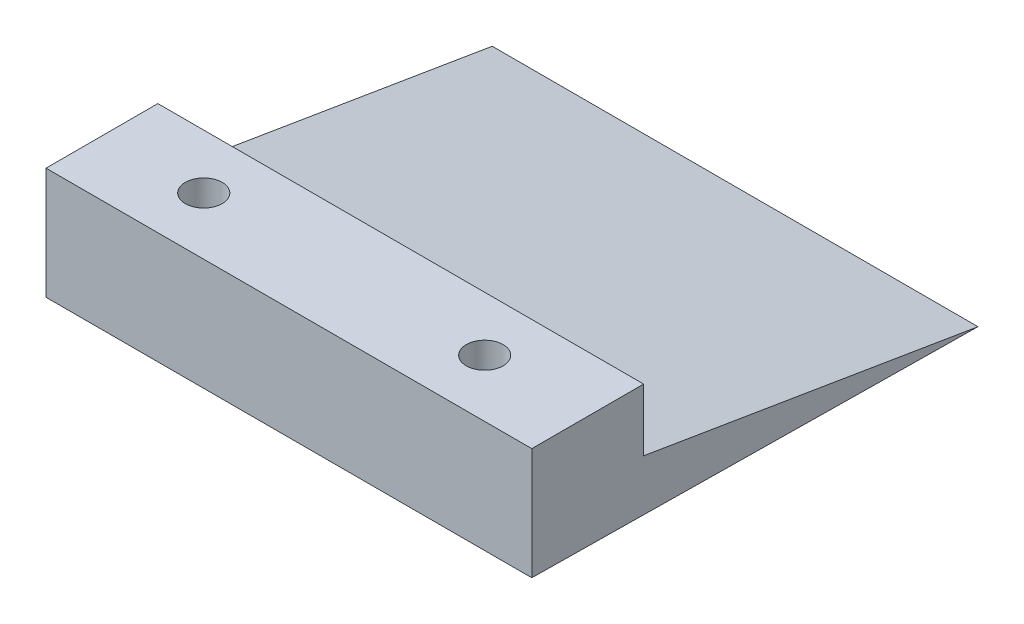
ISO-10303-21;
HEADER;
FILE_DESCRIPTION(('STEP AP214'),'2;1');
FILE_NAME('part.step','',(''),(''),'','','');
FILE_SCHEMA(('AUTOMOTIVE_DESIGN { 1 0 10303 214 1 1 1 1 }'));
ENDSEC;
DATA;
#1=APPLICATION_CONTEXT('core data for automotive mechanical design processes');
#2=APPLICATION_PROTOCOL_DEFINITION('international standard','automotive_design',2000,#1);
#3=PRODUCT_CONTEXT('',#1,'mechanical');
#4=PRODUCT('Part','Part','',(#3));
#5=PRODUCT_RELATED_PRODUCT_CATEGORY('part','',(#4));
#6=PRODUCT_DEFINITION_FORMATION('','',#4);
#7=PRODUCT_DEFINITION_CONTEXT('part definition',#1,'design');
#8=PRODUCT_DEFINITION('design','',#6,#7);
#9=PRODUCT_DEFINITION_SHAPE('','',#8);
#10=(LENGTH_UNIT() NAMED_UNIT(*) SI_UNIT(.MILLI.,.METRE.));
#11=(NAMED_UNIT(*) PLANE_ANGLE_UNIT() SI_UNIT($,.RADIAN.));
#12=(NAMED_UNIT(*) SI_UNIT($,.STERADIAN.) SOLID_ANGLE_UNIT());
#13=UNCERTAINTY_MEASURE_WITH_UNIT(LENGTH_MEASURE(1.E-05),#10,'distance_accuracy_value','');
#14=(GEOMETRIC_REPRESENTATION_CONTEXT(3) GLOBAL_UNCERTAINTY_ASSIGNED_CONTEXT((#13)) GLOBAL_UNIT_ASSIGNED_CONTEXT((#10,
#11,#12)) REPRESENTATION_CONTEXT('',''));
#15=CARTESIAN_POINT('',(0.,0.,0.));
#16=DIRECTION('',(0.,0.,1.));
#17=DIRECTION('',(1.,0.,0.));
#18=AXIS2_PLACEMENT_3D('',#15,#16,#17);
#19=CARTESIAN_POINT('',(21.5,5.5,9.9));
#20=DIRECTION('',(0.,0.,-1.));
#21=DIRECTION('',(0.,1.,0.));
#22=AXIS2_PLACEMENT_3D('',#19,#20,#21);
#23=PLANE('',#22);
#24=DIRECTION('',(0.,-1.,0.));
#25=VECTOR('',#24,1.);
#26=CARTESIAN_POINT('',(-21.5,5.5,9.9));
#27=LINE('',#26,#25);
#28=CARTESIAN_POINT('',(-21.5,5.5,9.9));
#29=VERTEX_POINT('',#28);
#30=CARTESIAN_POINT('',(-21.5,-4.4,9.9));
#31=VERTEX_POINT('',#30);
#32=EDGE_CURVE('E109',#29,#31,#27,.T.);
#33=ORIENTED_EDGE('',*,*,#32,.T.);
#34=DIRECTION('',(-1.,0.,0.));
#35=VECTOR('',#34,1.);
#36=CARTESIAN_POINT('',(21.5,-4.4,9.9));
#37=LINE('',#36,#35);
#38=CARTESIAN_POINT('',(21.5,-4.4,9.9));
#39=VERTEX_POINT('',#38);
#40=EDGE_CURVE('E11',#39,#31,#37,.T.);
#41=ORIENTED_EDGE('',*,*,#40,.F.);
#42=DIRECTION('',(0.,-1.,0.));
#43=VECTOR('',#42,1.);
#44=CARTESIAN_POINT('',(21.5,5.5,9.9));
#45=LINE('',#44,#43);
#46=CARTESIAN_POINT('',(21.5,5.5,9.9));
#47=VERTEX_POINT('',#46);
#48=EDGE_CURVE('E118',#47,#39,#45,.T.);
#49=ORIENTED_EDGE('',*,*,#48,.F.);
#50=DIRECTION('',(-1.,0.,0.));
#51=VECTOR('',#50,1.);
#52=CARTESIAN_POINT('',(21.5,5.5,9.9));
#53=LINE('',#52,#51);
#54=EDGE_CURVE('E105',#47,#29,#53,.T.);
#55=ORIENTED_EDGE('',*,*,#54,.T.);
#56=EDGE_LOOP('',(#33,#41,#49,#55));
#57=FACE_BOUND('',#56,.T.);
#58=ADVANCED_FACE('F33',(#57),#23,.F.);
#59=CARTESIAN_POINT('',(21.5,-4.90191570066803,-29.5968110184787));
#60=DIRECTION('',(0.,0.999919266290601,-0.0127067265991904));
#61=DIRECTION('',(0.,0.0127067265991904,0.999919266290601));
#62=AXIS2_PLACEMENT_3D('',#59,#60,#61);
#63=PLANE('',#62);
#64=CARTESIAN_POINT('',(-12.615,-4.4629033750888,4.95));
#65=DIRECTION('',(0.,-0.999919266290601,0.0127067265991904));
#66=DIRECTION('',(0.,-0.0127067265991904,-0.999919266290601));
#67=AXIS2_PLACEMENT_3D('',#64,#65,#66);
#68=CIRCLE('',#67,2.77875999999999);
#69=CARTESIAN_POINT('',(-12.615,-4.49821231869357,2.17146433960233));
#70=VERTEX_POINT('',#69);
#71=EDGE_CURVE('E183',#70,#70,#68,.T.);
#72=ORIENTED_EDGE('',*,*,#71,.F.);
#73=EDGE_LOOP('',(#72));
#74=FACE_BOUND('',#73,.T.);
#75=CARTESIAN_POINT('',(12.255,-4.4629033750888,4.95));
#76=DIRECTION('',(0.,-0.999919266290601,0.0127067265991904));
#77=DIRECTION('',(0.,-0.0127067265991904,-0.999919266290601));
#78=AXIS2_PLACEMENT_3D('',#75,#76,#77);
#79=CIRCLE('',#78,2.77875999999999);
#80=CARTESIAN_POINT('',(12.255,-4.49821231869357,2.17146433960233));
#81=VERTEX_POINT('',#80);
#82=EDGE_CURVE('E131',#81,#81,#79,.T.);
#83=ORIENTED_EDGE('',*,*,#82,.F.);
#84=EDGE_LOOP('',(#83));
#85=FACE_BOUND('',#84,.T.);
#86=DIRECTION('',(0.,-0.0127067265991904,-0.999919266290601));
#87=VECTOR('',#86,1.);
#88=CARTESIAN_POINT('',(-21.5,-4.90191570066803,-29.5968110184787));
#89=LINE('',#88,#87);
#90=CARTESIAN_POINT('',(-21.5,-4.90191570066803,-29.5968110184787));
#91=VERTEX_POINT('',#90);
#92=EDGE_CURVE('E112',#31,#91,#89,.T.);
#93=ORIENTED_EDGE('',*,*,#92,.T.);
#94=DIRECTION('',(-1.,0.,0.));
#95=VECTOR('',#94,1.);
#96=CARTESIAN_POINT('',(21.5,-4.90191570066803,-29.5968110184787));
#97=LINE('',#96,#95);
#98=CARTESIAN_POINT('',(21.5,-4.90191570066803,-29.5968110184787));
#99=VERTEX_POINT('',#98);
#100=EDGE_CURVE('E42',#99,#91,#97,.T.);
#101=ORIENTED_EDGE('',*,*,#100,.F.);
#102=DIRECTION('',(0.,-0.0127067265991904,-0.999919266290601));
#103=VECTOR('',#102,1.);
#104=CARTESIAN_POINT('',(21.5,-4.90191570066803,-29.5968110184787));
#105=LINE('',#104,#103);
#106=EDGE_CURVE('E85',#39,#99,#105,.T.);
#107=ORIENTED_EDGE('',*,*,#106,.F.);
#108=ORIENTED_EDGE('',*,*,#40,.T.);
#109=EDGE_LOOP('',(#93,#101,#107,#108));
#110=FACE_BOUND('',#109,.T.);
#111=ADVANCED_FACE('F139',(#74,#85,#110),#63,.F.);
#112=CARTESIAN_POINT('',(21.5,0.,0.));
#113=DIRECTION('',(0.,-0.986560367282625,0.163397190022268));
#114=DIRECTION('',(0.,-0.163397190022268,-0.986560367282625));
#115=AXIS2_PLACEMENT_3D('',#112,#113,#114);
#116=PLANE('',#115);
#117=DIRECTION('',(0.,0.163397190022268,0.986560367282625));
#118=VECTOR('',#117,1.);
#119=CARTESIAN_POINT('',(-21.5,0.,0.));
#120=LINE('',#119,#118);
#121=CARTESIAN_POINT('',(-21.5,0.,0.));
#122=VERTEX_POINT('',#121);
#123=EDGE_CURVE('E100',#91,#122,#120,.T.);
#124=ORIENTED_EDGE('',*,*,#123,.T.);
#125=DIRECTION('',(-1.,0.,0.));
#126=VECTOR('',#125,1.);
#127=CARTESIAN_POINT('',(21.5,0.,0.));
#128=LINE('',#127,#126);
#129=CARTESIAN_POINT('',(21.5,0.,0.));
#130=VERTEX_POINT('',#129);
#131=EDGE_CURVE('E97',#130,#122,#128,.T.);
#132=ORIENTED_EDGE('',*,*,#131,.F.);
#133=DIRECTION('',(0.,0.163397190022268,0.986560367282625));
#134=VECTOR('',#133,1.);
#135=CARTESIAN_POINT('',(21.5,0.,0.));
#136=LINE('',#135,#134);
#137=EDGE_CURVE('E89',#99,#130,#136,.T.);
#138=ORIENTED_EDGE('',*,*,#137,.F.);
#139=ORIENTED_EDGE('',*,*,#100,.T.);
#140=EDGE_LOOP('',(#124,#132,#138,#139));
#141=FACE_BOUND('',#140,.T.);
#142=ADVANCED_FACE('F98',(#141),#116,.F.);
#143=CARTESIAN_POINT('',(21.5,5.5,0.));
#144=DIRECTION('',(0.,0.,1.));
#145=DIRECTION('',(0.,-1.,0.));
#146=AXIS2_PLACEMENT_3D('',#143,#144,#145);
#147=PLANE('',#146);
#148=DIRECTION('',(0.,1.,0.));
#149=VECTOR('',#148,1.);
#150=CARTESIAN_POINT('',(-21.5,5.5,0.));
#151=LINE('',#150,#149);
#152=CARTESIAN_POINT('',(-21.5,5.5,0.));
#153=VERTEX_POINT('',#152);
#154=EDGE_CURVE('E71',#122,#153,#151,.T.);
#155=ORIENTED_EDGE('',*,*,#154,.T.);
#156=DIRECTION('',(-1.,0.,0.));
#157=VECTOR('',#156,1.);
#158=CARTESIAN_POINT('',(21.5,5.5,0.));
#159=LINE('',#158,#157);
#160=CARTESIAN_POINT('',(21.5,5.5,0.));
#161=VERTEX_POINT('',#160);
#162=EDGE_CURVE('E101',#161,#153,#159,.T.);
#163=ORIENTED_EDGE('',*,*,#162,.F.);
#164=DIRECTION('',(0.,1.,0.));
#165=VECTOR('',#164,1.);
#166=CARTESIAN_POINT('',(21.5,5.5,0.));
#167=LINE('',#166,#165);
#168=EDGE_CURVE('E93',#130,#161,#167,.T.);
#169=ORIENTED_EDGE('',*,*,#168,.F.);
#170=ORIENTED_EDGE('',*,*,#131,.T.);
#171=EDGE_LOOP('',(#155,#163,#169,#170));
#172=FACE_BOUND('',#171,.T.);
#173=ADVANCED_FACE('F103',(#172),#147,.F.);
#174=CARTESIAN_POINT('',(21.5,5.5,9.9));
#175=DIRECTION('',(0.,-1.,0.));
#176=DIRECTION('',(0.,0.,-1.));
#177=AXIS2_PLACEMENT_3D('',#174,#175,#176);
#178=PLANE('',#177);
#179=CARTESIAN_POINT('',(-12.615,5.5,4.82339388929764));
#180=DIRECTION('',(0.,-1.,0.));
#181=DIRECTION('',(0.,0.,1.));
#182=AXIS2_PLACEMENT_3D('',#179,#180,#181);
#183=ELLIPSE('',#182,1.63208176401485,1.63195);
#184=CARTESIAN_POINT('',(-12.615,5.5,6.45547565331249));
#185=VERTEX_POINT('',#184);
#186=EDGE_CURVE('E36',#185,#185,#183,.T.);
#187=ORIENTED_EDGE('',*,*,#186,.T.);
#188=EDGE_LOOP('',(#187));
#189=FACE_BOUND('',#188,.T.);
#190=CARTESIAN_POINT('',(12.255,5.5,4.82339388929764));
#191=DIRECTION('',(0.,-1.,0.));
#192=DIRECTION('',(0.,0.,1.));
#193=AXIS2_PLACEMENT_3D('',#190,#191,#192);
#194=ELLIPSE('',#193,1.63208176401485,1.63195);
#195=CARTESIAN_POINT('',(12.255,5.5,6.45547565331249));
#196=VERTEX_POINT('',#195);
#197=EDGE_CURVE('E113',#196,#196,#194,.T.);
#198=ORIENTED_EDGE('',*,*,#197,.T.);
#199=EDGE_LOOP('',(#198));
#200=FACE_BOUND('',#199,.T.);
#201=DIRECTION('',(0.,0.,1.));
#202=VECTOR('',#201,1.);
#203=CARTESIAN_POINT('',(-21.5,5.5,9.9));
#204=LINE('',#203,#202);
#205=EDGE_CURVE('E77',#153,#29,#204,.T.);
#206=ORIENTED_EDGE('',*,*,#205,.T.);
#207=ORIENTED_EDGE('',*,*,#54,.F.);
#208=DIRECTION('',(0.,0.,1.));
#209=VECTOR('',#208,1.);
#210=CARTESIAN_POINT('',(21.5,5.5,9.9));
#211=LINE('',#210,#209);
#212=EDGE_CURVE('E51',#161,#47,#211,.T.);
#213=ORIENTED_EDGE('',*,*,#212,.F.);
#214=ORIENTED_EDGE('',*,*,#162,.T.);
#215=EDGE_LOOP('',(#206,#207,#213,#214));
#216=FACE_BOUND('',#215,.T.);
#217=ADVANCED_FACE('F151',(#189,#200,#216),#178,.F.);
#218=CARTESIAN_POINT('',(21.5,0.,0.));
#219=DIRECTION('',(1.,0.,0.));
#220=DIRECTION('',(0.,0.,-1.));
#221=AXIS2_PLACEMENT_3D('',#218,#219,#220);
#222=PLANE('',#221);
#223=ORIENTED_EDGE('',*,*,#48,.T.);
#224=ORIENTED_EDGE('',*,*,#106,.T.);
#225=ORIENTED_EDGE('',*,*,#137,.T.);
#226=ORIENTED_EDGE('',*,*,#168,.T.);
#227=ORIENTED_EDGE('',*,*,#212,.T.);
#228=EDGE_LOOP('',(#223,#224,#225,#226,#227));
#229=FACE_BOUND('',#228,.T.);
#230=ADVANCED_FACE('F91',(#229),#222,.T.);
#231=CARTESIAN_POINT('',(-21.5,0.,0.));
#232=DIRECTION('',(1.,0.,0.));
#233=DIRECTION('',(0.,0.,-1.));
#234=AXIS2_PLACEMENT_3D('',#231,#232,#233);
#235=PLANE('',#234);
#236=ORIENTED_EDGE('',*,*,#32,.F.);
#237=ORIENTED_EDGE('',*,*,#205,.F.);
#238=ORIENTED_EDGE('',*,*,#154,.F.);
#239=ORIENTED_EDGE('',*,*,#123,.F.);
#240=ORIENTED_EDGE('',*,*,#92,.F.);
#241=EDGE_LOOP('',(#236,#237,#238,#239,#240));
#242=FACE_BOUND('',#241,.T.);
#243=ADVANCED_FACE('F141',(#242),#235,.F.);
#244=CARTESIAN_POINT('',(12.255,-4.4629033750888,4.95));
#245=DIRECTION('',(0.,-0.999919266290601,0.0127067265991904));
#246=DIRECTION('',(0.,-0.0127067265991904,-0.999919266290601));
#247=AXIS2_PLACEMENT_3D('',#244,#245,#246);
#248=CYLINDRICAL_SURFACE('',#247,1.63195);
#249=CARTESIAN_POINT('',(12.255,2.38133601946297,4.86302509942767));
#250=DIRECTION('',(0.,-0.999919266290601,0.0127067265991904));
#251=DIRECTION('',(0.,-0.0127067265991904,-0.999919266290601));
#252=AXIS2_PLACEMENT_3D('',#249,#250,#251);
#253=CIRCLE('',#252,1.63195);
#254=CARTESIAN_POINT('',(12.255,2.36059927698942,3.23120685280473));
#255=VERTEX_POINT('',#254);
#256=EDGE_CURVE('E122',#255,#255,#253,.T.);
#257=ORIENTED_EDGE('',*,*,#256,.T.);
#258=EDGE_LOOP('',(#257));
#259=FACE_BOUND('',#258,.T.);
#260=ORIENTED_EDGE('',*,*,#197,.F.);
#261=EDGE_LOOP('',(#260));
#262=FACE_BOUND('',#261,.T.);
#263=ADVANCED_FACE('F143',(#259,#262),#248,.F.);
#264=CARTESIAN_POINT('',(13.88695,2.38133601946297,4.86302509942767));
#265=DIRECTION('',(0.,0.999919266290601,-0.0127067265991904));
#266=DIRECTION('',(0.,0.0127067265991904,0.999919266290601));
#267=AXIS2_PLACEMENT_3D('',#264,#265,#266);
#268=PLANE('',#267);
#269=ORIENTED_EDGE('',*,*,#256,.F.);
#270=EDGE_LOOP('',(#269));
#271=FACE_BOUND('',#270,.T.);
#272=CARTESIAN_POINT('',(12.255,2.38133601946297,4.86302509942767));
#273=DIRECTION('',(0.,-0.999919266290601,0.0127067265991904));
#274=DIRECTION('',(0.,-0.0127067265991904,-0.999919266290601));
#275=AXIS2_PLACEMENT_3D('',#272,#273,#274);
#276=CIRCLE('',#275,2.77876);
#277=CARTESIAN_POINT('',(12.255,2.34602707585821,2.08448943903));
#278=VERTEX_POINT('',#277);
#279=EDGE_CURVE('E126',#278,#278,#276,.T.);
#280=ORIENTED_EDGE('',*,*,#279,.T.);
#281=EDGE_LOOP('',(#280));
#282=FACE_BOUND('',#281,.T.);
#283=ADVANCED_FACE('F149',(#271,#282),#268,.F.);
#284=CARTESIAN_POINT('',(12.255,-4.4629033750888,4.95));
#285=DIRECTION('',(0.,-0.999919266290601,0.0127067265991904));
#286=DIRECTION('',(0.,-0.0127067265991904,-0.999919266290601));
#287=AXIS2_PLACEMENT_3D('',#284,#285,#286);
#288=CYLINDRICAL_SURFACE('',#287,2.77876);
#289=ORIENTED_EDGE('',*,*,#279,.F.);
#290=EDGE_LOOP('',(#289));
#291=FACE_BOUND('',#290,.T.);
#292=ORIENTED_EDGE('',*,*,#82,.T.);
#293=EDGE_LOOP('',(#292));
#294=FACE_BOUND('',#293,.T.);
#295=ADVANCED_FACE('F203',(#291,#294),#288,.F.);
#296=CARTESIAN_POINT('',(-12.615,-4.4629033750888,4.95));
#297=DIRECTION('',(0.,-0.999919266290601,0.0127067265991904));
#298=DIRECTION('',(0.,-0.0127067265991904,-0.999919266290601));
#299=AXIS2_PLACEMENT_3D('',#296,#297,#298);
#300=CYLINDRICAL_SURFACE('',#299,1.63195);
#301=CARTESIAN_POINT('',(-12.615,2.38133601946297,4.86302509942767));
#302=DIRECTION('',(0.,-0.999919266290601,0.0127067265991904));
#303=DIRECTION('',(0.,-0.0127067265991904,-0.999919266290601));
#304=AXIS2_PLACEMENT_3D('',#301,#302,#303);
#305=CIRCLE('',#304,1.63195);
#306=CARTESIAN_POINT('',(-12.615,2.36059927698942,3.23120685280473));
#307=VERTEX_POINT('',#306);
#308=EDGE_CURVE('E175',#307,#307,#305,.T.);
#309=ORIENTED_EDGE('',*,*,#308,.T.);
#310=EDGE_LOOP('',(#309));
#311=FACE_BOUND('',#310,.T.);
#312=ORIENTED_EDGE('',*,*,#186,.F.);
#313=EDGE_LOOP('',(#312));
#314=FACE_BOUND('',#313,.T.);
#315=ADVANCED_FACE('F196',(#311,#314),#300,.F.);
#316=CARTESIAN_POINT('',(-10.98305,2.38133601946297,4.86302509942767));
#317=DIRECTION('',(0.,0.999919266290601,-0.0127067265991904));
#318=DIRECTION('',(0.,0.0127067265991904,0.999919266290601));
#319=AXIS2_PLACEMENT_3D('',#316,#317,#318);
#320=PLANE('',#319);
#321=ORIENTED_EDGE('',*,*,#308,.F.);
#322=EDGE_LOOP('',(#321));
#323=FACE_BOUND('',#322,.T.);
#324=CARTESIAN_POINT('',(-12.615,2.38133601946297,4.86302509942767));
#325=DIRECTION('',(0.,-0.999919266290601,0.0127067265991904));
#326=DIRECTION('',(0.,-0.0127067265991904,-0.999919266290601));
#327=AXIS2_PLACEMENT_3D('',#324,#325,#326);
#328=CIRCLE('',#327,2.77876);
#329=CARTESIAN_POINT('',(-12.615,2.34602707585821,2.08448943903));
#330=VERTEX_POINT('',#329);
#331=EDGE_CURVE('E178',#330,#330,#328,.T.);
#332=ORIENTED_EDGE('',*,*,#331,.T.);
#333=EDGE_LOOP('',(#332));
#334=FACE_BOUND('',#333,.T.);
#335=ADVANCED_FACE('F190',(#323,#334),#320,.F.);
#336=CARTESIAN_POINT('',(-12.615,-4.4629033750888,4.95));
#337=DIRECTION('',(0.,-0.999919266290601,0.0127067265991904));
#338=DIRECTION('',(0.,-0.0127067265991904,-0.999919266290601));
#339=AXIS2_PLACEMENT_3D('',#336,#337,#338);
#340=CYLINDRICAL_SURFACE('',#339,2.77876);
#341=ORIENTED_EDGE('',*,*,#331,.F.);
#342=EDGE_LOOP('',(#341));
#343=FACE_BOUND('',#342,.T.);
#344=ORIENTED_EDGE('',*,*,#71,.T.);
#345=EDGE_LOOP('',(#344));
#346=FACE_BOUND('',#345,.T.);
#347=ADVANCED_FACE('F188',(#343,#346),#340,.F.);
#348=CLOSED_SHELL('',(#58,#111,#142,#173,#217,#230,#243,#263,#283,#295,#315,#335,#347));
#349=MANIFOLD_SOLID_BREP('B2',#348);
#350=ADVANCED_BREP_SHAPE_REPRESENTATION('',(#18,#349),#14);
#351=SHAPE_DEFINITION_REPRESENTATION(#9,#350);
ENDSEC;
END-ISO-10303-21;
